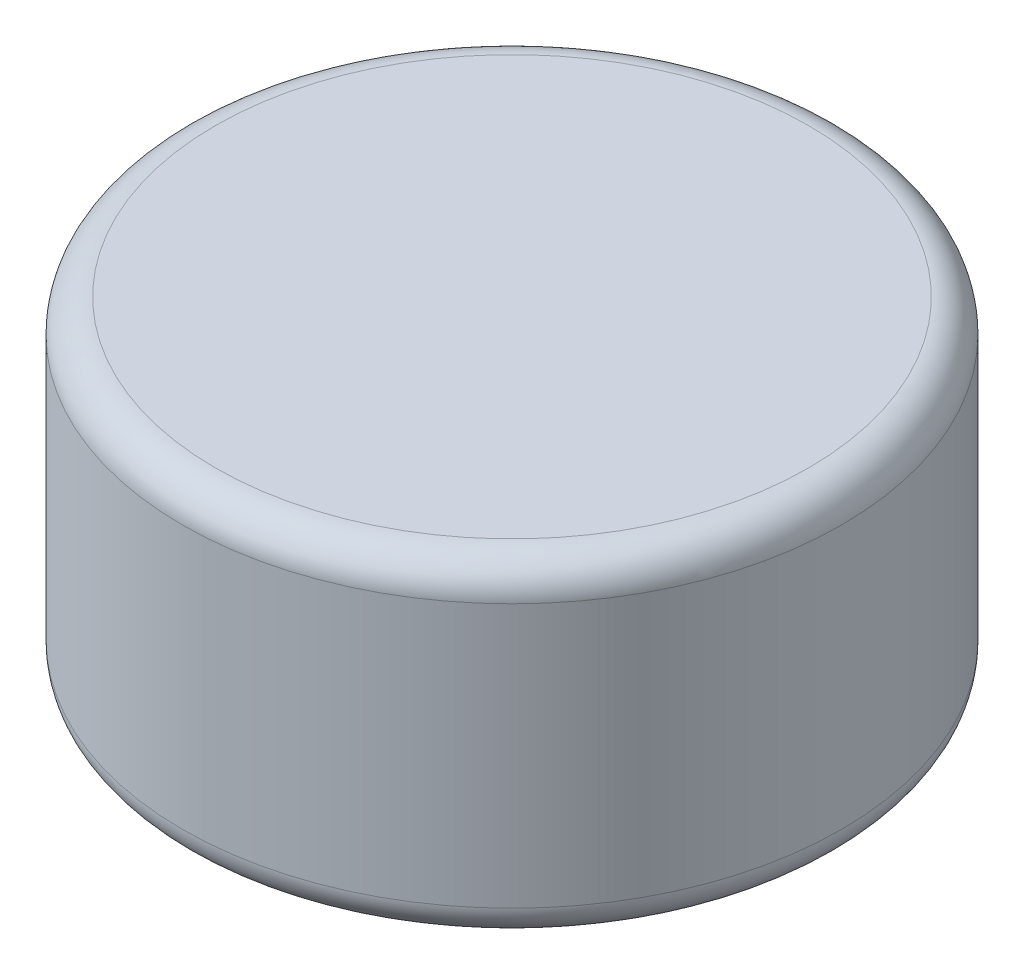
ISO-10303-21;
HEADER;
FILE_DESCRIPTION(('STEP AP214'),'2;1');
FILE_NAME('part.step','',(''),(''),'','','');
FILE_SCHEMA(('AUTOMOTIVE_DESIGN { 1 0 10303 214 1 1 1 1 }'));
ENDSEC;
DATA;
#1=APPLICATION_CONTEXT('core data for automotive mechanical design processes');
#2=APPLICATION_PROTOCOL_DEFINITION('international standard','automotive_design',2000,#1);
#3=PRODUCT_CONTEXT('',#1,'mechanical');
#4=PRODUCT('Part','Part','',(#3));
#5=PRODUCT_RELATED_PRODUCT_CATEGORY('part','',(#4));
#6=PRODUCT_DEFINITION_FORMATION('','',#4);
#7=PRODUCT_DEFINITION_CONTEXT('part definition',#1,'design');
#8=PRODUCT_DEFINITION('design','',#6,#7);
#9=PRODUCT_DEFINITION_SHAPE('','',#8);
#10=(LENGTH_UNIT() NAMED_UNIT(*) SI_UNIT(.MILLI.,.METRE.));
#11=(NAMED_UNIT(*) PLANE_ANGLE_UNIT() SI_UNIT($,.RADIAN.));
#12=(NAMED_UNIT(*) SI_UNIT($,.STERADIAN.) SOLID_ANGLE_UNIT());
#13=UNCERTAINTY_MEASURE_WITH_UNIT(LENGTH_MEASURE(1.E-05),#10,'distance_accuracy_value','');
#14=(GEOMETRIC_REPRESENTATION_CONTEXT(3) GLOBAL_UNCERTAINTY_ASSIGNED_CONTEXT((#13)) GLOBAL_UNIT_ASSIGNED_CONTEXT((#10,
#11,#12)) REPRESENTATION_CONTEXT('',''));
#15=CARTESIAN_POINT('',(0.,0.,0.));
#16=DIRECTION('',(0.,0.,1.));
#17=DIRECTION('',(1.,0.,0.));
#18=AXIS2_PLACEMENT_3D('',#15,#16,#17);
#19=CARTESIAN_POINT('',(0.,1.58750000000002,0.));
#20=DIRECTION('',(0.,-1.,0.));
#21=DIRECTION('',(0.,0.,-1.00000000000001));
#22=AXIS2_PLACEMENT_3D('',#19,#20,#21);
#23=CYLINDRICAL_SURFACE('',#22,3.175);
#24=CARTESIAN_POINT('',(6.59194920871187E-13,-1.26999999999997,0.));
#25=DIRECTION('',(0.,1.,0.));
#26=DIRECTION('',(0.,0.,1.00000000000001));
#27=AXIS2_PLACEMENT_3D('',#24,#25,#26);
#28=CIRCLE('',#27,3.175);
#29=CARTESIAN_POINT('',(6.6307237478469E-13,-1.26999999999997,3.17499999999999));
#30=VERTEX_POINT('',#29);
#31=EDGE_CURVE('E45',#30,#30,#28,.T.);
#32=ORIENTED_EDGE('',*,*,#31,.T.);
#33=EDGE_LOOP('',(#32));
#34=FACE_BOUND('',#33,.T.);
#35=CARTESIAN_POINT('',(-1.73472347597681E-13,1.26999999999999,0.));
#36=DIRECTION('',(0.,1.,0.));
#37=DIRECTION('',(0.,0.,1.00000000000001));
#38=AXIS2_PLACEMENT_3D('',#35,#36,#37);
#39=CIRCLE('',#38,3.175);
#40=CARTESIAN_POINT('',(-1.69594893684177E-13,1.26999999999999,3.17499999999999));
#41=VERTEX_POINT('',#40);
#42=EDGE_CURVE('E49',#41,#41,#39,.F.);
#43=ORIENTED_EDGE('',*,*,#42,.T.);
#44=EDGE_LOOP('',(#43));
#45=FACE_BOUND('',#44,.T.);
#46=ADVANCED_FACE('F34',(#34,#45),#23,.T.);
#47=CARTESIAN_POINT('',(0.,1.58750000000002,0.));
#48=DIRECTION('',(0.,1.,0.));
#49=DIRECTION('',(0.,0.,1.00000000000001));
#50=AXIS2_PLACEMENT_3D('',#47,#48,#49);
#51=PLANE('',#50);
#52=CARTESIAN_POINT('',(0.,1.58750000000002,0.));
#53=DIRECTION('',(0.,1.,0.));
#54=DIRECTION('',(0.,0.,1.00000000000001));
#55=AXIS2_PLACEMENT_3D('',#52,#53,#54);
#56=CIRCLE('',#55,2.8575);
#57=CARTESIAN_POINT('',(0.,1.58750000000002,2.85750000000002));
#58=VERTEX_POINT('',#57);
#59=EDGE_CURVE('E10',#58,#58,#56,.T.);
#60=ORIENTED_EDGE('',*,*,#59,.T.);
#61=EDGE_LOOP('',(#60));
#62=FACE_BOUND('',#61,.T.);
#63=ADVANCED_FACE('F65',(#62),#51,.T.);
#64=CARTESIAN_POINT('',(3.40005801291454E-13,-1.58749999999999,0.));
#65=DIRECTION('',(0.,1.,0.));
#66=DIRECTION('',(0.,0.,1.00000000000001));
#67=AXIS2_PLACEMENT_3D('',#64,#65,#66);
#68=PLANE('',#67);
#69=CARTESIAN_POINT('',(3.40005801291454E-13,-1.58749999999999,0.));
#70=DIRECTION('',(0.,1.,0.));
#71=DIRECTION('',(0.,0.,1.00000000000001));
#72=AXIS2_PLACEMENT_3D('',#69,#70,#71);
#73=CIRCLE('',#72,2.8575);
#74=CARTESIAN_POINT('',(3.43495509813607E-13,-1.58749999999999,2.85750000000007));
#75=VERTEX_POINT('',#74);
#76=EDGE_CURVE('E41',#75,#75,#73,.F.);
#77=ORIENTED_EDGE('',*,*,#76,.T.);
#78=EDGE_LOOP('',(#77));
#79=FACE_BOUND('',#78,.T.);
#80=ADVANCED_FACE('F62',(#79),#68,.F.);
#81=CARTESIAN_POINT('',(6.59194920871187E-13,-1.26999999999997,0.));
#82=DIRECTION('',(0.,1.,0.));
#83=DIRECTION('',(0.,0.,1.00000000000001));
#84=AXIS2_PLACEMENT_3D('',#81,#82,#83);
#85=TOROIDAL_SURFACE('',#84,2.8575,0.3175);
#86=ORIENTED_EDGE('',*,*,#76,.F.);
#87=EDGE_LOOP('',(#86));
#88=FACE_BOUND('',#87,.T.);
#89=ORIENTED_EDGE('',*,*,#31,.F.);
#90=EDGE_LOOP('',(#89));
#91=FACE_BOUND('',#90,.T.);
#92=ADVANCED_FACE('F58',(#88,#91),#85,.T.);
#93=CARTESIAN_POINT('',(-1.73472347597681E-13,1.26999999999999,0.));
#94=DIRECTION('',(0.,1.,0.));
#95=DIRECTION('',(0.,0.,1.00000000000001));
#96=AXIS2_PLACEMENT_3D('',#93,#94,#95);
#97=TOROIDAL_SURFACE('',#96,2.8575,0.3175);
#98=ORIENTED_EDGE('',*,*,#42,.F.);
#99=EDGE_LOOP('',(#98));
#100=FACE_BOUND('',#99,.T.);
#101=ORIENTED_EDGE('',*,*,#59,.F.);
#102=EDGE_LOOP('',(#101));
#103=FACE_BOUND('',#102,.T.);
#104=ADVANCED_FACE('F36',(#100,#103),#97,.T.);
#105=CLOSED_SHELL('',(#46,#63,#80,#92,#104));
#106=MANIFOLD_SOLID_BREP('B2',#105);
#107=ADVANCED_BREP_SHAPE_REPRESENTATION('',(#18,#106),#14);
#108=SHAPE_DEFINITION_REPRESENTATION(#9,#107);
ENDSEC;
END-ISO-10303-21;
